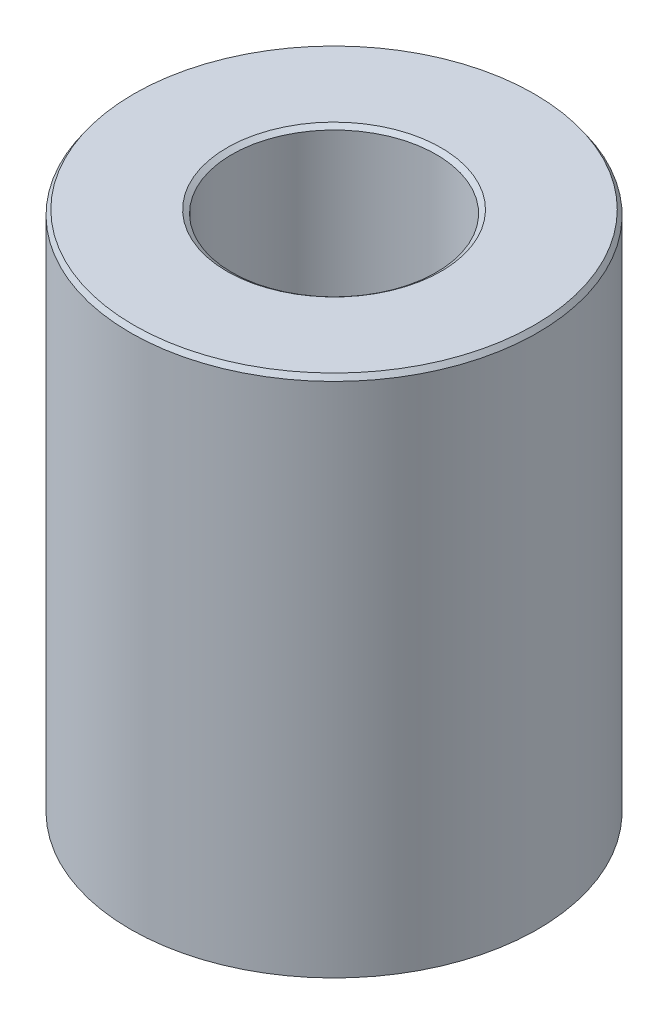
ISO-10303-21;
HEADER;
FILE_DESCRIPTION(('STEP AP214'),'2;1');
FILE_NAME('part.step','',(''),(''),'','','');
FILE_SCHEMA(('AUTOMOTIVE_DESIGN { 1 0 10303 214 1 1 1 1 }'));
ENDSEC;
DATA;
#1=APPLICATION_CONTEXT('core data for automotive mechanical design processes');
#2=APPLICATION_PROTOCOL_DEFINITION('international standard','automotive_design',2000,#1);
#3=PRODUCT_CONTEXT('',#1,'mechanical');
#4=PRODUCT('Part','Part','',(#3));
#5=PRODUCT_RELATED_PRODUCT_CATEGORY('part','',(#4));
#6=PRODUCT_DEFINITION_FORMATION('','',#4);
#7=PRODUCT_DEFINITION_CONTEXT('part definition',#1,'design');
#8=PRODUCT_DEFINITION('design','',#6,#7);
#9=PRODUCT_DEFINITION_SHAPE('','',#8);
#10=(LENGTH_UNIT() NAMED_UNIT(*) SI_UNIT(.MILLI.,.METRE.));
#11=(NAMED_UNIT(*) PLANE_ANGLE_UNIT() SI_UNIT($,.RADIAN.));
#12=(NAMED_UNIT(*) SI_UNIT($,.STERADIAN.) SOLID_ANGLE_UNIT());
#13=UNCERTAINTY_MEASURE_WITH_UNIT(LENGTH_MEASURE(1.E-05),#10,'distance_accuracy_value','');
#14=(GEOMETRIC_REPRESENTATION_CONTEXT(3) GLOBAL_UNCERTAINTY_ASSIGNED_CONTEXT((#13)) GLOBAL_UNIT_ASSIGNED_CONTEXT((#10,
#11,#12)) REPRESENTATION_CONTEXT('',''));
#15=CARTESIAN_POINT('',(0.,0.,0.));
#16=DIRECTION('',(0.,0.,1.));
#17=DIRECTION('',(1.,0.,0.));
#18=AXIS2_PLACEMENT_3D('',#15,#16,#17);
#19=CARTESIAN_POINT('',(0.,109.524880379925,0.));
#20=DIRECTION('',(0.,-1.,0.));
#21=DIRECTION('',(0.,0.,-1.));
#22=AXIS2_PLACEMENT_3D('',#19,#20,#21);
#23=CYLINDRICAL_SURFACE('',#22,42.5);
#24=CARTESIAN_POINT('',(0.,0.708426404782053,0.));
#25=DIRECTION('',(0.,1.,0.));
#26=DIRECTION('',(0.,0.,1.));
#27=AXIS2_PLACEMENT_3D('',#24,#25,#26);
#28=CIRCLE('',#27,42.5);
#29=CARTESIAN_POINT('',(0.,0.708426404782053,42.5));
#30=VERTEX_POINT('',#29);
#31=EDGE_CURVE('E10',#30,#30,#28,.T.);
#32=ORIENTED_EDGE('',*,*,#31,.T.);
#33=EDGE_LOOP('',(#32));
#34=FACE_BOUND('',#33,.T.);
#35=CARTESIAN_POINT('',(0.,108.508549401984,0.));
#36=DIRECTION('',(0.,1.,0.));
#37=DIRECTION('',(0.,0.,1.));
#38=AXIS2_PLACEMENT_3D('',#35,#36,#37);
#39=CIRCLE('',#38,42.5);
#40=CARTESIAN_POINT('',(0.,108.508549401984,42.5));
#41=VERTEX_POINT('',#40);
#42=EDGE_CURVE('E50',#41,#41,#39,.F.);
#43=ORIENTED_EDGE('',*,*,#42,.T.);
#44=EDGE_LOOP('',(#43));
#45=FACE_BOUND('',#44,.T.);
#46=ADVANCED_FACE('F39',(#34,#45),#23,.T.);
#47=CARTESIAN_POINT('',(0.,109.524880379925,0.));
#48=DIRECTION('',(0.,1.,0.));
#49=DIRECTION('',(0.,0.,1.));
#50=AXIS2_PLACEMENT_3D('',#47,#48,#49);
#51=PLANE('',#50);
#52=CARTESIAN_POINT('',(0.,109.524880379925,0.));
#53=DIRECTION('',(0.,1.,0.));
#54=DIRECTION('',(0.,0.,1.));
#55=AXIS2_PLACEMENT_3D('',#52,#53,#54);
#56=CIRCLE('',#55,22.3467329845841);
#57=CARTESIAN_POINT('',(0.,109.524880379925,22.3467329845841));
#58=VERTEX_POINT('',#57);
#59=EDGE_CURVE('E58',#58,#58,#56,.F.);
#60=ORIENTED_EDGE('',*,*,#59,.T.);
#61=EDGE_LOOP('',(#60));
#62=FACE_BOUND('',#61,.T.);
#63=CARTESIAN_POINT('',(0.,109.524880379925,0.));
#64=DIRECTION('',(0.,1.,0.));
#65=DIRECTION('',(0.,0.,1.));
#66=AXIS2_PLACEMENT_3D('',#63,#64,#65);
#67=CIRCLE('',#66,41.7915735952179);
#68=CARTESIAN_POINT('',(0.,109.524880379925,41.7915735952179));
#69=VERTEX_POINT('',#68);
#70=EDGE_CURVE('E61',#69,#69,#67,.T.);
#71=ORIENTED_EDGE('',*,*,#70,.T.);
#72=EDGE_LOOP('',(#71));
#73=FACE_BOUND('',#72,.T.);
#74=ADVANCED_FACE('F88',(#62,#73),#51,.T.);
#75=CARTESIAN_POINT('',(0.,0.,0.));
#76=DIRECTION('',(0.,1.,0.));
#77=DIRECTION('',(0.,0.,1.));
#78=AXIS2_PLACEMENT_3D('',#75,#76,#77);
#79=PLANE('',#78);
#80=CARTESIAN_POINT('',(0.,0.,0.));
#81=DIRECTION('',(0.,1.,0.));
#82=DIRECTION('',(0.,0.,1.));
#83=AXIS2_PLACEMENT_3D('',#80,#81,#82);
#84=CIRCLE('',#83,22.0388284114259);
#85=CARTESIAN_POINT('',(0.,0.,22.0388284114259));
#86=VERTEX_POINT('',#85);
#87=EDGE_CURVE('E51',#86,#86,#84,.T.);
#88=ORIENTED_EDGE('',*,*,#87,.T.);
#89=EDGE_LOOP('',(#88));
#90=FACE_BOUND('',#89,.T.);
#91=CARTESIAN_POINT('',(0.,0.,0.));
#92=DIRECTION('',(0.,1.,0.));
#93=DIRECTION('',(0.,0.,1.));
#94=AXIS2_PLACEMENT_3D('',#91,#92,#93);
#95=CIRCLE('',#94,41.4836690220597);
#96=CARTESIAN_POINT('',(0.,0.,41.4836690220597));
#97=VERTEX_POINT('',#96);
#98=EDGE_CURVE('E54',#97,#97,#95,.F.);
#99=ORIENTED_EDGE('',*,*,#98,.T.);
#100=EDGE_LOOP('',(#99));
#101=FACE_BOUND('',#100,.T.);
#102=ADVANCED_FACE('F83',(#90,#101),#79,.F.);
#103=CARTESIAN_POINT('',(0.,109.524880379925,0.));
#104=DIRECTION('',(0.,-1.,0.));
#105=DIRECTION('',(0.,0.,-1.));
#106=AXIS2_PLACEMENT_3D('',#103,#104,#105);
#107=CYLINDRICAL_SURFACE('',#106,21.3304020066438);
#108=CARTESIAN_POINT('',(0.,108.816453975143,0.));
#109=DIRECTION('',(0.,1.,0.));
#110=DIRECTION('',(0.,0.,1.));
#111=AXIS2_PLACEMENT_3D('',#108,#109,#110);
#112=CIRCLE('',#111,21.3304020066438);
#113=CARTESIAN_POINT('',(0.,108.816453975143,21.3304020066438));
#114=VERTEX_POINT('',#113);
#115=EDGE_CURVE('E67',#114,#114,#112,.T.);
#116=ORIENTED_EDGE('',*,*,#115,.T.);
#117=EDGE_LOOP('',(#116));
#118=FACE_BOUND('',#117,.T.);
#119=CARTESIAN_POINT('',(0.,1.01633097794032,0.));
#120=DIRECTION('',(0.,1.,0.));
#121=DIRECTION('',(0.,0.,1.));
#122=AXIS2_PLACEMENT_3D('',#119,#120,#121);
#123=CIRCLE('',#122,21.3304020066438);
#124=CARTESIAN_POINT('',(0.,1.01633097794032,21.3304020066438));
#125=VERTEX_POINT('',#124);
#126=EDGE_CURVE('E69',#125,#125,#123,.F.);
#127=ORIENTED_EDGE('',*,*,#126,.T.);
#128=EDGE_LOOP('',(#127));
#129=FACE_BOUND('',#128,.T.);
#130=ADVANCED_FACE('F71',(#118,#129),#107,.F.);
#131=CARTESIAN_POINT('',(0.,108.816453975143,0.));
#132=DIRECTION('',(0.,1.,0.));
#133=DIRECTION('',(0.,0.,1.));
#134=AXIS2_PLACEMENT_3D('',#131,#132,#133);
#135=CONICAL_SURFACE('',#134,21.3304020066438,0.9620576770935);
#136=ORIENTED_EDGE('',*,*,#59,.F.);
#137=EDGE_LOOP('',(#136));
#138=FACE_BOUND('',#137,.T.);
#139=ORIENTED_EDGE('',*,*,#115,.F.);
#140=EDGE_LOOP('',(#139));
#141=FACE_BOUND('',#140,.T.);
#142=ADVANCED_FACE('F77',(#138,#141),#135,.F.);
#143=CARTESIAN_POINT('',(0.,0.,0.));
#144=DIRECTION('',(0.,-1.,0.));
#145=DIRECTION('',(0.,0.,-1.));
#146=AXIS2_PLACEMENT_3D('',#143,#144,#145);
#147=CONICAL_SURFACE('',#146,22.0388284114259,0.608738649701385);
#148=ORIENTED_EDGE('',*,*,#126,.F.);
#149=EDGE_LOOP('',(#148));
#150=FACE_BOUND('',#149,.T.);
#151=ORIENTED_EDGE('',*,*,#87,.F.);
#152=EDGE_LOOP('',(#151));
#153=FACE_BOUND('',#152,.T.);
#154=ADVANCED_FACE('F73',(#150,#153),#147,.F.);
#155=CARTESIAN_POINT('',(0.,0.708426404782053,0.));
#156=DIRECTION('',(0.,1.,0.));
#157=DIRECTION('',(0.,0.,1.));
#158=AXIS2_PLACEMENT_3D('',#155,#156,#157);
#159=CONICAL_SURFACE('',#158,42.5,0.962057677093508);
#160=ORIENTED_EDGE('',*,*,#98,.F.);
#161=EDGE_LOOP('',(#160));
#162=FACE_BOUND('',#161,.T.);
#163=ORIENTED_EDGE('',*,*,#31,.F.);
#164=EDGE_LOOP('',(#163));
#165=FACE_BOUND('',#164,.T.);
#166=ADVANCED_FACE('F76',(#162,#165),#159,.T.);
#167=CARTESIAN_POINT('',(0.,109.524880379925,0.));
#168=DIRECTION('',(0.,-1.,0.));
#169=DIRECTION('',(0.,0.,-1.));
#170=AXIS2_PLACEMENT_3D('',#167,#168,#169);
#171=CONICAL_SURFACE('',#170,41.7915735952179,0.608738649701388);
#172=ORIENTED_EDGE('',*,*,#42,.F.);
#173=EDGE_LOOP('',(#172));
#174=FACE_BOUND('',#173,.T.);
#175=ORIENTED_EDGE('',*,*,#70,.F.);
#176=EDGE_LOOP('',(#175));
#177=FACE_BOUND('',#176,.T.);
#178=ADVANCED_FACE('F45',(#174,#177),#171,.T.);
#179=CLOSED_SHELL('',(#46,#74,#102,#130,#142,#154,#166,#178));
#180=MANIFOLD_SOLID_BREP('B2',#179);
#181=ADVANCED_BREP_SHAPE_REPRESENTATION('',(#18,#180),#14);
#182=SHAPE_DEFINITION_REPRESENTATION(#9,#181);
ENDSEC;
END-ISO-10303-21;
